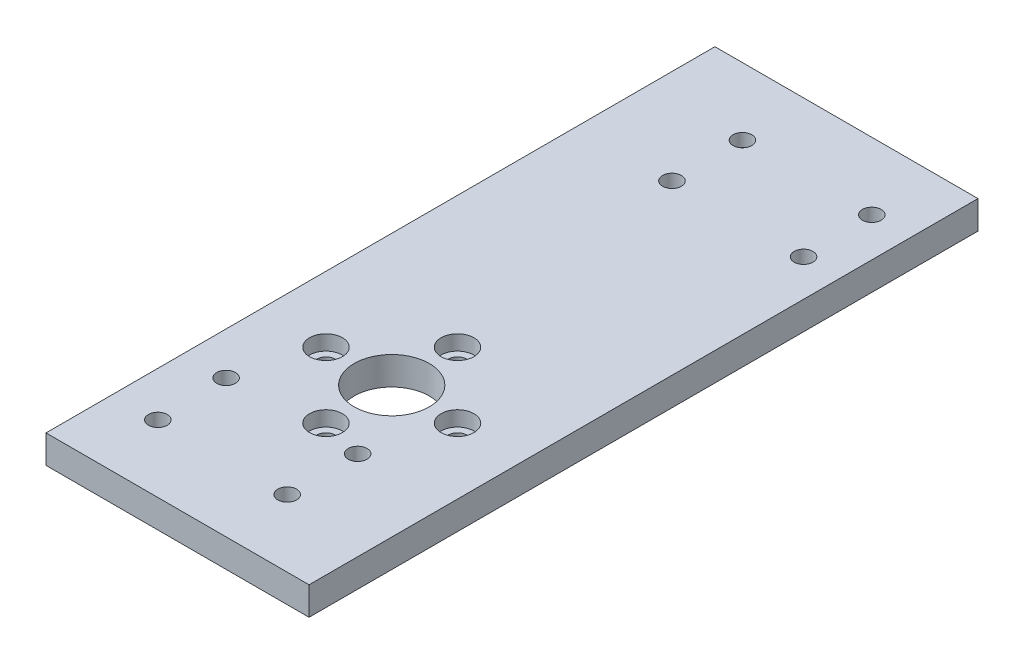
ISO-10303-21;
HEADER;
FILE_DESCRIPTION(('STEP AP214'),'2;1');
FILE_NAME('part.step','',(''),(''),'','','');
FILE_SCHEMA(('AUTOMOTIVE_DESIGN { 1 0 10303 214 1 1 1 1 }'));
ENDSEC;
DATA;
#1=APPLICATION_CONTEXT('core data for automotive mechanical design processes');
#2=APPLICATION_PROTOCOL_DEFINITION('international standard','automotive_design',2000,#1);
#3=PRODUCT_CONTEXT('',#1,'mechanical');
#4=PRODUCT('Part','Part','',(#3));
#5=PRODUCT_RELATED_PRODUCT_CATEGORY('part','',(#4));
#6=PRODUCT_DEFINITION_FORMATION('','',#4);
#7=PRODUCT_DEFINITION_CONTEXT('part definition',#1,'design');
#8=PRODUCT_DEFINITION('design','',#6,#7);
#9=PRODUCT_DEFINITION_SHAPE('','',#8);
#10=(LENGTH_UNIT() NAMED_UNIT(*) SI_UNIT(.MILLI.,.METRE.));
#11=(NAMED_UNIT(*) PLANE_ANGLE_UNIT() SI_UNIT($,.RADIAN.));
#12=(NAMED_UNIT(*) SI_UNIT($,.STERADIAN.) SOLID_ANGLE_UNIT());
#13=UNCERTAINTY_MEASURE_WITH_UNIT(LENGTH_MEASURE(1.E-05),#10,'distance_accuracy_value','');
#14=(GEOMETRIC_REPRESENTATION_CONTEXT(3) GLOBAL_UNCERTAINTY_ASSIGNED_CONTEXT((#13)) GLOBAL_UNIT_ASSIGNED_CONTEXT((#10,
#11,#12)) REPRESENTATION_CONTEXT('',''));
#15=CARTESIAN_POINT('',(0.,0.,0.));
#16=DIRECTION('',(0.,0.,1.));
#17=DIRECTION('',(1.,0.,0.));
#18=AXIS2_PLACEMENT_3D('',#15,#16,#17);
#19=CARTESIAN_POINT('',(-3.91877513505073,-7.,-28.4481628818932));
#20=DIRECTION('',(0.,1.,0.));
#21=DIRECTION('',(0.,0.,1.));
#22=AXIS2_PLACEMENT_3D('',#19,#20,#21);
#23=CYLINDRICAL_SURFACE('',#22,1.00000000000001);
#24=CARTESIAN_POINT('',(-3.91877513505073,3.,-28.4481628818932));
#25=DIRECTION('',(0.,1.,0.));
#26=DIRECTION('',(0.,0.,1.));
#27=AXIS2_PLACEMENT_3D('',#24,#25,#26);
#28=CIRCLE('',#27,1.00000000000001);
#29=CARTESIAN_POINT('',(-3.91877513505073,3.,-27.4481628818932));
#30=VERTEX_POINT('',#29);
#31=EDGE_CURVE('E244',#30,#30,#28,.T.);
#32=ORIENTED_EDGE('',*,*,#31,.T.);
#33=EDGE_LOOP('',(#32));
#34=FACE_BOUND('',#33,.T.);
#35=CARTESIAN_POINT('',(-3.91877513505073,1.6,-28.4481628818932));
#36=DIRECTION('',(0.,-1.,0.));
#37=DIRECTION('',(0.,0.,-1.));
#38=AXIS2_PLACEMENT_3D('',#35,#36,#37);
#39=CIRCLE('',#38,1.00000000000001);
#40=CARTESIAN_POINT('',(-3.91877513505073,1.6,-29.4481628818932));
#41=VERTEX_POINT('',#40);
#42=EDGE_CURVE('E43',#41,#41,#39,.F.);
#43=ORIENTED_EDGE('',*,*,#42,.F.);
#44=EDGE_LOOP('',(#43));
#45=FACE_BOUND('',#44,.T.);
#46=ADVANCED_FACE('F39',(#34,#45),#23,.F.);
#47=CARTESIAN_POINT('',(4.51877513505392,-7.,20.9481628818913));
#48=DIRECTION('',(0.,1.,0.));
#49=DIRECTION('',(0.,0.,1.));
#50=AXIS2_PLACEMENT_3D('',#47,#48,#49);
#51=CYLINDRICAL_SURFACE('',#50,1.00000000000002);
#52=CARTESIAN_POINT('',(4.51877513505392,3.,20.9481628818913));
#53=DIRECTION('',(0.,1.,0.));
#54=DIRECTION('',(0.,0.,1.));
#55=AXIS2_PLACEMENT_3D('',#52,#53,#54);
#56=CIRCLE('',#55,1.00000000000002);
#57=CARTESIAN_POINT('',(4.51877513505392,3.,21.9481628818913));
#58=VERTEX_POINT('',#57);
#59=EDGE_CURVE('E247',#58,#58,#56,.T.);
#60=ORIENTED_EDGE('',*,*,#59,.T.);
#61=EDGE_LOOP('',(#60));
#62=FACE_BOUND('',#61,.T.);
#63=CARTESIAN_POINT('',(4.51877513505392,1.6,20.9481628818913));
#64=DIRECTION('',(0.,-1.,0.));
#65=DIRECTION('',(0.,0.,-1.));
#66=AXIS2_PLACEMENT_3D('',#63,#64,#65);
#67=CIRCLE('',#66,1.00000000000002);
#68=CARTESIAN_POINT('',(4.51877513505392,1.6,19.9481628818913));
#69=VERTEX_POINT('',#68);
#70=EDGE_CURVE('E179',#69,#69,#67,.F.);
#71=ORIENTED_EDGE('',*,*,#70,.F.);
#72=EDGE_LOOP('',(#71));
#73=FACE_BOUND('',#72,.T.);
#74=ADVANCED_FACE('F280',(#62,#73),#51,.F.);
#75=CARTESIAN_POINT('',(4.51877513505393,-7.,28.4481628818913));
#76=DIRECTION('',(0.,1.,0.));
#77=DIRECTION('',(0.,0.,1.));
#78=AXIS2_PLACEMENT_3D('',#75,#76,#77);
#79=CYLINDRICAL_SURFACE('',#78,1.00000000000002);
#80=CARTESIAN_POINT('',(4.51877513505393,3.,28.4481628818913));
#81=DIRECTION('',(0.,1.,0.));
#82=DIRECTION('',(0.,0.,1.));
#83=AXIS2_PLACEMENT_3D('',#80,#81,#82);
#84=CIRCLE('',#83,1.00000000000002);
#85=CARTESIAN_POINT('',(4.51877513505393,3.,29.4481628818913));
#86=VERTEX_POINT('',#85);
#87=EDGE_CURVE('E250',#86,#86,#84,.T.);
#88=ORIENTED_EDGE('',*,*,#87,.T.);
#89=EDGE_LOOP('',(#88));
#90=FACE_BOUND('',#89,.T.);
#91=CARTESIAN_POINT('',(4.51877513505393,1.6,28.4481628818913));
#92=DIRECTION('',(0.,-1.,0.));
#93=DIRECTION('',(0.,0.,-1.));
#94=AXIS2_PLACEMENT_3D('',#91,#92,#93);
#95=CIRCLE('',#94,1.00000000000002);
#96=CARTESIAN_POINT('',(4.51877513505393,1.6,27.4481628818913));
#97=VERTEX_POINT('',#96);
#98=EDGE_CURVE('E175',#97,#97,#95,.F.);
#99=ORIENTED_EDGE('',*,*,#98,.F.);
#100=EDGE_LOOP('',(#99));
#101=FACE_BOUND('',#100,.T.);
#102=ADVANCED_FACE('F286',(#90,#101),#79,.F.);
#103=CARTESIAN_POINT('',(-9.48122486494609,-7.,20.9481628818913));
#104=DIRECTION('',(0.,1.,0.));
#105=DIRECTION('',(0.,0.,1.));
#106=AXIS2_PLACEMENT_3D('',#103,#104,#105);
#107=CYLINDRICAL_SURFACE('',#106,1.00000000000001);
#108=CARTESIAN_POINT('',(-9.48122486494609,3.,20.9481628818913));
#109=DIRECTION('',(0.,1.,0.));
#110=DIRECTION('',(0.,0.,1.));
#111=AXIS2_PLACEMENT_3D('',#108,#109,#110);
#112=CIRCLE('',#111,1.00000000000001);
#113=CARTESIAN_POINT('',(-9.48122486494609,3.,21.9481628818913));
#114=VERTEX_POINT('',#113);
#115=EDGE_CURVE('E256',#114,#114,#112,.T.);
#116=ORIENTED_EDGE('',*,*,#115,.T.);
#117=EDGE_LOOP('',(#116));
#118=FACE_BOUND('',#117,.T.);
#119=CARTESIAN_POINT('',(-9.48122486494609,1.6,20.9481628818913));
#120=DIRECTION('',(0.,-1.,0.));
#121=DIRECTION('',(0.,0.,-1.));
#122=AXIS2_PLACEMENT_3D('',#119,#120,#121);
#123=CIRCLE('',#122,1.00000000000001);
#124=CARTESIAN_POINT('',(-9.48122486494609,1.6,19.9481628818913));
#125=VERTEX_POINT('',#124);
#126=EDGE_CURVE('E170',#125,#125,#123,.F.);
#127=ORIENTED_EDGE('',*,*,#126,.F.);
#128=EDGE_LOOP('',(#127));
#129=FACE_BOUND('',#128,.T.);
#130=ADVANCED_FACE('F296',(#118,#129),#107,.F.);
#131=CARTESIAN_POINT('',(-9.24883244467996,-7.,28.4481628818913));
#132=DIRECTION('',(0.,1.,0.));
#133=DIRECTION('',(0.,0.,1.));
#134=AXIS2_PLACEMENT_3D('',#131,#132,#133);
#135=CYLINDRICAL_SURFACE('',#134,1.00000000000001);
#136=CARTESIAN_POINT('',(-9.24883244467996,3.,28.4481628818913));
#137=DIRECTION('',(0.,1.,0.));
#138=DIRECTION('',(0.,0.,1.));
#139=AXIS2_PLACEMENT_3D('',#136,#137,#138);
#140=CIRCLE('',#139,1.00000000000001);
#141=CARTESIAN_POINT('',(-9.24883244467996,3.,29.4481628818913));
#142=VERTEX_POINT('',#141);
#143=EDGE_CURVE('E253',#142,#142,#140,.T.);
#144=ORIENTED_EDGE('',*,*,#143,.T.);
#145=EDGE_LOOP('',(#144));
#146=FACE_BOUND('',#145,.T.);
#147=CARTESIAN_POINT('',(-9.24883244467996,1.6,28.4481628818913));
#148=DIRECTION('',(0.,-1.,0.));
#149=DIRECTION('',(0.,0.,-1.));
#150=AXIS2_PLACEMENT_3D('',#147,#148,#149);
#151=CIRCLE('',#150,1.00000000000001);
#152=CARTESIAN_POINT('',(-9.24883244467996,1.6,27.4481628818913));
#153=VERTEX_POINT('',#152);
#154=EDGE_CURVE('E165',#153,#153,#151,.F.);
#155=ORIENTED_EDGE('',*,*,#154,.F.);
#156=EDGE_LOOP('',(#155));
#157=FACE_BOUND('',#156,.T.);
#158=ADVANCED_FACE('F298',(#146,#157),#135,.F.);
#159=CARTESIAN_POINT('',(10.0812248649493,-7.,-20.9481628818932));
#160=DIRECTION('',(0.,1.,0.));
#161=DIRECTION('',(0.,0.,1.));
#162=AXIS2_PLACEMENT_3D('',#159,#160,#161);
#163=CYLINDRICAL_SURFACE('',#162,1.);
#164=CARTESIAN_POINT('',(10.0812248649493,3.,-20.9481628818932));
#165=DIRECTION('',(0.,1.,0.));
#166=DIRECTION('',(0.,0.,1.));
#167=AXIS2_PLACEMENT_3D('',#164,#165,#166);
#168=CIRCLE('',#167,1.);
#169=CARTESIAN_POINT('',(10.0812248649493,3.,-19.9481628818932));
#170=VERTEX_POINT('',#169);
#171=EDGE_CURVE('E238',#170,#170,#168,.T.);
#172=ORIENTED_EDGE('',*,*,#171,.T.);
#173=EDGE_LOOP('',(#172));
#174=FACE_BOUND('',#173,.T.);
#175=CARTESIAN_POINT('',(10.0812248649493,1.6,-20.9481628818932));
#176=DIRECTION('',(0.,-1.,0.));
#177=DIRECTION('',(0.,0.,-1.));
#178=AXIS2_PLACEMENT_3D('',#175,#176,#177);
#179=CIRCLE('',#178,1.);
#180=CARTESIAN_POINT('',(10.0812248649493,1.6,-21.9481628818932));
#181=VERTEX_POINT('',#180);
#182=EDGE_CURVE('E160',#181,#181,#179,.F.);
#183=ORIENTED_EDGE('',*,*,#182,.F.);
#184=EDGE_LOOP('',(#183));
#185=FACE_BOUND('',#184,.T.);
#186=ADVANCED_FACE('F301',(#174,#185),#163,.F.);
#187=CARTESIAN_POINT('',(9.84883244468316,-7.,-28.4481628818932));
#188=DIRECTION('',(0.,1.,0.));
#189=DIRECTION('',(0.,0.,1.));
#190=AXIS2_PLACEMENT_3D('',#187,#188,#189);
#191=CYLINDRICAL_SURFACE('',#190,1.00000000000001);
#192=CARTESIAN_POINT('',(9.84883244468316,3.,-28.4481628818932));
#193=DIRECTION('',(0.,1.,0.));
#194=DIRECTION('',(0.,0.,1.));
#195=AXIS2_PLACEMENT_3D('',#192,#193,#194);
#196=CIRCLE('',#195,1.00000000000001);
#197=CARTESIAN_POINT('',(9.84883244468316,3.,-27.4481628818932));
#198=VERTEX_POINT('',#197);
#199=EDGE_CURVE('E241',#198,#198,#196,.T.);
#200=ORIENTED_EDGE('',*,*,#199,.T.);
#201=EDGE_LOOP('',(#200));
#202=FACE_BOUND('',#201,.T.);
#203=CARTESIAN_POINT('',(9.84883244468316,1.6,-28.4481628818932));
#204=DIRECTION('',(0.,-1.,0.));
#205=DIRECTION('',(0.,0.,-1.));
#206=AXIS2_PLACEMENT_3D('',#203,#204,#205);
#207=CIRCLE('',#206,1.00000000000001);
#208=CARTESIAN_POINT('',(9.84883244468316,1.6,-29.4481628818932));
#209=VERTEX_POINT('',#208);
#210=EDGE_CURVE('E155',#209,#209,#207,.F.);
#211=ORIENTED_EDGE('',*,*,#210,.F.);
#212=EDGE_LOOP('',(#211));
#213=FACE_BOUND('',#212,.T.);
#214=ADVANCED_FACE('F291',(#202,#213),#191,.F.);
#215=CARTESIAN_POINT('',(-3.91877513505072,-7.,-20.9481628818932));
#216=DIRECTION('',(0.,1.,0.));
#217=DIRECTION('',(0.,0.,1.));
#218=AXIS2_PLACEMENT_3D('',#215,#216,#217);
#219=CYLINDRICAL_SURFACE('',#218,1.00000000000001);
#220=CARTESIAN_POINT('',(-3.91877513505072,3.,-20.9481628818932));
#221=DIRECTION('',(0.,1.,0.));
#222=DIRECTION('',(0.,0.,1.));
#223=AXIS2_PLACEMENT_3D('',#220,#221,#222);
#224=CIRCLE('',#223,1.00000000000001);
#225=CARTESIAN_POINT('',(-3.91877513505072,3.,-19.9481628818932));
#226=VERTEX_POINT('',#225);
#227=EDGE_CURVE('E133',#226,#226,#224,.T.);
#228=ORIENTED_EDGE('',*,*,#227,.T.);
#229=EDGE_LOOP('',(#228));
#230=FACE_BOUND('',#229,.T.);
#231=CARTESIAN_POINT('',(-3.91877513505072,1.6,-20.9481628818932));
#232=DIRECTION('',(0.,-1.,0.));
#233=DIRECTION('',(0.,0.,-1.));
#234=AXIS2_PLACEMENT_3D('',#231,#232,#233);
#235=CIRCLE('',#234,1.00000000000001);
#236=CARTESIAN_POINT('',(-3.91877513505072,1.6,-21.9481628818932));
#237=VERTEX_POINT('',#236);
#238=EDGE_CURVE('E150',#237,#237,#235,.F.);
#239=ORIENTED_EDGE('',*,*,#238,.F.);
#240=EDGE_LOOP('',(#239));
#241=FACE_BOUND('',#240,.T.);
#242=ADVANCED_FACE('F321',(#230,#241),#219,.F.);
#243=CARTESIAN_POINT('',(7.0000000000001,-7.,12.7999999999978));
#244=DIRECTION('',(0.,1.,0.));
#245=DIRECTION('',(0.,0.,1.));
#246=AXIS2_PLACEMENT_3D('',#243,#244,#245);
#247=CYLINDRICAL_SURFACE('',#246,1.);
#248=CARTESIAN_POINT('',(7.0000000000001,0.,12.7999999999978));
#249=DIRECTION('',(0.,-1.,0.));
#250=DIRECTION('',(0.,0.,-1.));
#251=AXIS2_PLACEMENT_3D('',#248,#249,#250);
#252=CIRCLE('',#251,1.);
#253=CARTESIAN_POINT('',(7.0000000000001,0.,11.7999999999978));
#254=VERTEX_POINT('',#253);
#255=EDGE_CURVE('E117',#254,#254,#252,.T.);
#256=ORIENTED_EDGE('',*,*,#255,.T.);
#257=EDGE_LOOP('',(#256));
#258=FACE_BOUND('',#257,.T.);
#259=CARTESIAN_POINT('',(7.0000000000001,1.4,12.7999999999978));
#260=DIRECTION('',(0.,1.,0.));
#261=DIRECTION('',(0.,0.,1.));
#262=AXIS2_PLACEMENT_3D('',#259,#260,#261);
#263=CIRCLE('',#262,1.);
#264=CARTESIAN_POINT('',(7.0000000000001,1.4,13.7999999999978));
#265=VERTEX_POINT('',#264);
#266=EDGE_CURVE('E145',#265,#265,#263,.F.);
#267=ORIENTED_EDGE('',*,*,#266,.F.);
#268=EDGE_LOOP('',(#267));
#269=FACE_BOUND('',#268,.T.);
#270=ADVANCED_FACE('F314',(#258,#269),#247,.F.);
#271=CARTESIAN_POINT('',(-6.9999999999999,-7.,12.7999999999979));
#272=DIRECTION('',(0.,1.,0.));
#273=DIRECTION('',(0.,0.,1.));
#274=AXIS2_PLACEMENT_3D('',#271,#272,#273);
#275=CYLINDRICAL_SURFACE('',#274,1.);
#276=CARTESIAN_POINT('',(-6.9999999999999,0.,12.7999999999979));
#277=DIRECTION('',(0.,-1.,0.));
#278=DIRECTION('',(0.,0.,-1.));
#279=AXIS2_PLACEMENT_3D('',#276,#277,#278);
#280=CIRCLE('',#279,1.);
#281=CARTESIAN_POINT('',(-6.9999999999999,0.,11.7999999999979));
#282=VERTEX_POINT('',#281);
#283=EDGE_CURVE('E123',#282,#282,#280,.T.);
#284=ORIENTED_EDGE('',*,*,#283,.T.);
#285=EDGE_LOOP('',(#284));
#286=FACE_BOUND('',#285,.T.);
#287=CARTESIAN_POINT('',(-6.9999999999999,1.4,12.7999999999979));
#288=DIRECTION('',(0.,1.,0.));
#289=DIRECTION('',(0.,0.,1.));
#290=AXIS2_PLACEMENT_3D('',#287,#288,#289);
#291=CIRCLE('',#290,1.);
#292=CARTESIAN_POINT('',(-6.9999999999999,1.4,13.7999999999979));
#293=VERTEX_POINT('',#292);
#294=EDGE_CURVE('E140',#293,#293,#291,.F.);
#295=ORIENTED_EDGE('',*,*,#294,.F.);
#296=EDGE_LOOP('',(#295));
#297=FACE_BOUND('',#296,.T.);
#298=ADVANCED_FACE('F310',(#286,#297),#275,.F.);
#299=CARTESIAN_POINT('',(0.,-7.,5.79999999999792));
#300=DIRECTION('',(0.,1.,0.));
#301=DIRECTION('',(0.,0.,1.));
#302=AXIS2_PLACEMENT_3D('',#299,#300,#301);
#303=CYLINDRICAL_SURFACE('',#302,1.);
#304=CARTESIAN_POINT('',(0.,0.,5.79999999999792));
#305=DIRECTION('',(0.,-1.,0.));
#306=DIRECTION('',(0.,0.,-1.));
#307=AXIS2_PLACEMENT_3D('',#304,#305,#306);
#308=CIRCLE('',#307,1.);
#309=CARTESIAN_POINT('',(0.,0.,4.79999999999792));
#310=VERTEX_POINT('',#309);
#311=EDGE_CURVE('E109',#310,#310,#308,.T.);
#312=ORIENTED_EDGE('',*,*,#311,.T.);
#313=EDGE_LOOP('',(#312));
#314=FACE_BOUND('',#313,.T.);
#315=CARTESIAN_POINT('',(0.,1.4,5.79999999999792));
#316=DIRECTION('',(0.,1.,0.));
#317=DIRECTION('',(0.,0.,1.));
#318=AXIS2_PLACEMENT_3D('',#315,#316,#317);
#319=CIRCLE('',#318,1.);
#320=CARTESIAN_POINT('',(0.,1.4,6.79999999999792));
#321=VERTEX_POINT('',#320);
#322=EDGE_CURVE('E135',#321,#321,#319,.F.);
#323=ORIENTED_EDGE('',*,*,#322,.F.);
#324=EDGE_LOOP('',(#323));
#325=FACE_BOUND('',#324,.T.);
#326=ADVANCED_FACE('F313',(#314,#325),#303,.F.);
#327=CARTESIAN_POINT('',(1.45764745514838E-13,-7.,19.7999999999979));
#328=DIRECTION('',(0.,1.,0.));
#329=DIRECTION('',(0.,0.,1.));
#330=AXIS2_PLACEMENT_3D('',#327,#328,#329);
#331=CYLINDRICAL_SURFACE('',#330,1.);
#332=CARTESIAN_POINT('',(1.45764745514838E-13,0.,19.7999999999979));
#333=DIRECTION('',(0.,-1.,0.));
#334=DIRECTION('',(0.,0.,-1.));
#335=AXIS2_PLACEMENT_3D('',#332,#333,#334);
#336=CIRCLE('',#335,1.);
#337=CARTESIAN_POINT('',(1.45764745514838E-13,0.,18.7999999999979));
#338=VERTEX_POINT('',#337);
#339=EDGE_CURVE('E120',#338,#338,#336,.T.);
#340=ORIENTED_EDGE('',*,*,#339,.T.);
#341=EDGE_LOOP('',(#340));
#342=FACE_BOUND('',#341,.T.);
#343=CARTESIAN_POINT('',(1.45764745514838E-13,1.4,19.7999999999979));
#344=DIRECTION('',(0.,1.,0.));
#345=DIRECTION('',(0.,0.,1.));
#346=AXIS2_PLACEMENT_3D('',#343,#344,#345);
#347=CIRCLE('',#346,1.);
#348=CARTESIAN_POINT('',(1.45764745514838E-13,1.4,20.7999999999979));
#349=VERTEX_POINT('',#348);
#350=EDGE_CURVE('E130',#349,#349,#347,.F.);
#351=ORIENTED_EDGE('',*,*,#350,.F.);
#352=EDGE_LOOP('',(#351));
#353=FACE_BOUND('',#352,.T.);
#354=ADVANCED_FACE('F316',(#342,#353),#331,.F.);
#355=CARTESIAN_POINT('',(14.,3.,35.6));
#356=DIRECTION('',(-1.,0.,0.));
#357=DIRECTION('',(0.,0.,1.));
#358=AXIS2_PLACEMENT_3D('',#355,#356,#357);
#359=PLANE('',#358);
#360=DIRECTION('',(0.,0.,-1.));
#361=VECTOR('',#360,1.);
#362=CARTESIAN_POINT('',(14.,0.,35.6));
#363=LINE('',#362,#361);
#364=CARTESIAN_POINT('',(14.,0.,35.6));
#365=VERTEX_POINT('',#364);
#366=CARTESIAN_POINT('',(14.,0.,-35.6));
#367=VERTEX_POINT('',#366);
#368=EDGE_CURVE('E106',#365,#367,#363,.T.);
#369=ORIENTED_EDGE('',*,*,#368,.T.);
#370=DIRECTION('',(0.,-1.,0.));
#371=VECTOR('',#370,1.);
#372=CARTESIAN_POINT('',(14.,3.,-35.6));
#373=LINE('',#372,#371);
#374=CARTESIAN_POINT('',(14.,3.,-35.6));
#375=VERTEX_POINT('',#374);
#376=EDGE_CURVE('E11',#375,#367,#373,.T.);
#377=ORIENTED_EDGE('',*,*,#376,.F.);
#378=DIRECTION('',(0.,0.,-1.));
#379=VECTOR('',#378,1.);
#380=CARTESIAN_POINT('',(14.,3.,35.6));
#381=LINE('',#380,#379);
#382=CARTESIAN_POINT('',(14.,3.,35.6));
#383=VERTEX_POINT('',#382);
#384=EDGE_CURVE('E93',#383,#375,#381,.T.);
#385=ORIENTED_EDGE('',*,*,#384,.F.);
#386=DIRECTION('',(0.,-1.,0.));
#387=VECTOR('',#386,1.);
#388=CARTESIAN_POINT('',(14.,3.,35.6));
#389=LINE('',#388,#387);
#390=EDGE_CURVE('E102',#383,#365,#389,.T.);
#391=ORIENTED_EDGE('',*,*,#390,.T.);
#392=EDGE_LOOP('',(#369,#377,#385,#391));
#393=FACE_BOUND('',#392,.T.);
#394=ADVANCED_FACE('F41',(#393),#359,.F.);
#395=CARTESIAN_POINT('',(-14.,3.,-35.6));
#396=DIRECTION('',(0.,0.,1.));
#397=DIRECTION('',(1.,0.,0.));
#398=AXIS2_PLACEMENT_3D('',#395,#396,#397);
#399=PLANE('',#398);
#400=DIRECTION('',(-1.,0.,0.));
#401=VECTOR('',#400,1.);
#402=CARTESIAN_POINT('',(-14.,0.,-35.6));
#403=LINE('',#402,#401);
#404=CARTESIAN_POINT('',(-14.,0.,-35.6));
#405=VERTEX_POINT('',#404);
#406=EDGE_CURVE('E97',#367,#405,#403,.T.);
#407=ORIENTED_EDGE('',*,*,#406,.T.);
#408=DIRECTION('',(0.,-1.,0.));
#409=VECTOR('',#408,1.);
#410=CARTESIAN_POINT('',(-14.,3.,-35.6));
#411=LINE('',#410,#409);
#412=CARTESIAN_POINT('',(-14.,3.,-35.6));
#413=VERTEX_POINT('',#412);
#414=EDGE_CURVE('E49',#413,#405,#411,.T.);
#415=ORIENTED_EDGE('',*,*,#414,.F.);
#416=DIRECTION('',(-1.,0.,0.));
#417=VECTOR('',#416,1.);
#418=CARTESIAN_POINT('',(-14.,3.,-35.6));
#419=LINE('',#418,#417);
#420=EDGE_CURVE('E88',#375,#413,#419,.T.);
#421=ORIENTED_EDGE('',*,*,#420,.F.);
#422=ORIENTED_EDGE('',*,*,#376,.T.);
#423=EDGE_LOOP('',(#407,#415,#421,#422));
#424=FACE_BOUND('',#423,.T.);
#425=ADVANCED_FACE('F96',(#424),#399,.F.);
#426=CARTESIAN_POINT('',(-14.,3.,35.6));
#427=DIRECTION('',(1.,0.,0.));
#428=DIRECTION('',(0.,0.,-1.));
#429=AXIS2_PLACEMENT_3D('',#426,#427,#428);
#430=PLANE('',#429);
#431=DIRECTION('',(0.,0.,1.));
#432=VECTOR('',#431,1.);
#433=CARTESIAN_POINT('',(-14.,0.,35.6));
#434=LINE('',#433,#432);
#435=CARTESIAN_POINT('',(-14.,0.,35.6));
#436=VERTEX_POINT('',#435);
#437=EDGE_CURVE('E75',#405,#436,#434,.T.);
#438=ORIENTED_EDGE('',*,*,#437,.T.);
#439=DIRECTION('',(0.,-1.,0.));
#440=VECTOR('',#439,1.);
#441=CARTESIAN_POINT('',(-14.,3.,35.6));
#442=LINE('',#441,#440);
#443=CARTESIAN_POINT('',(-14.,3.,35.6));
#444=VERTEX_POINT('',#443);
#445=EDGE_CURVE('E98',#444,#436,#442,.T.);
#446=ORIENTED_EDGE('',*,*,#445,.F.);
#447=DIRECTION('',(0.,0.,1.));
#448=VECTOR('',#447,1.);
#449=CARTESIAN_POINT('',(-14.,3.,35.6));
#450=LINE('',#449,#448);
#451=EDGE_CURVE('E91',#413,#444,#450,.T.);
#452=ORIENTED_EDGE('',*,*,#451,.F.);
#453=ORIENTED_EDGE('',*,*,#414,.T.);
#454=EDGE_LOOP('',(#438,#446,#452,#453));
#455=FACE_BOUND('',#454,.T.);
#456=ADVANCED_FACE('F100',(#455),#430,.F.);
#457=CARTESIAN_POINT('',(-14.,3.,35.6));
#458=DIRECTION('',(0.,0.,-1.));
#459=DIRECTION('',(-1.,0.,0.));
#460=AXIS2_PLACEMENT_3D('',#457,#458,#459);
#461=PLANE('',#460);
#462=DIRECTION('',(1.,0.,0.));
#463=VECTOR('',#462,1.);
#464=CARTESIAN_POINT('',(-14.,0.,35.6));
#465=LINE('',#464,#463);
#466=EDGE_CURVE('E81',#436,#365,#465,.T.);
#467=ORIENTED_EDGE('',*,*,#466,.T.);
#468=ORIENTED_EDGE('',*,*,#390,.F.);
#469=DIRECTION('',(1.,0.,0.));
#470=VECTOR('',#469,1.);
#471=CARTESIAN_POINT('',(-14.,3.,35.6));
#472=LINE('',#471,#470);
#473=EDGE_CURVE('E58',#444,#383,#472,.T.);
#474=ORIENTED_EDGE('',*,*,#473,.F.);
#475=ORIENTED_EDGE('',*,*,#445,.T.);
#476=EDGE_LOOP('',(#467,#468,#474,#475));
#477=FACE_BOUND('',#476,.T.);
#478=ADVANCED_FACE('F266',(#477),#461,.F.);
#479=CARTESIAN_POINT('',(0.,3.,0.));
#480=DIRECTION('',(0.,-1.,0.));
#481=DIRECTION('',(0.,0.,-1.));
#482=AXIS2_PLACEMENT_3D('',#479,#480,#481);
#483=PLANE('',#482);
#484=CARTESIAN_POINT('',(7.0000000000001,3.,12.7999999999978));
#485=DIRECTION('',(0.,1.,0.));
#486=DIRECTION('',(0.,0.,1.));
#487=AXIS2_PLACEMENT_3D('',#484,#485,#486);
#488=CIRCLE('',#487,1.75);
#489=CARTESIAN_POINT('',(7.0000000000001,3.,14.5499999999978));
#490=VERTEX_POINT('',#489);
#491=EDGE_CURVE('E153',#490,#490,#488,.T.);
#492=ORIENTED_EDGE('',*,*,#491,.F.);
#493=EDGE_LOOP('',(#492));
#494=FACE_BOUND('',#493,.T.);
#495=CARTESIAN_POINT('',(-6.9999999999999,3.,12.7999999999979));
#496=DIRECTION('',(0.,1.,0.));
#497=DIRECTION('',(0.,0.,1.));
#498=AXIS2_PLACEMENT_3D('',#495,#496,#497);
#499=CIRCLE('',#498,1.75);
#500=CARTESIAN_POINT('',(-6.9999999999999,3.,14.5499999999979));
#501=VERTEX_POINT('',#500);
#502=EDGE_CURVE('E148',#501,#501,#499,.T.);
#503=ORIENTED_EDGE('',*,*,#502,.F.);
#504=EDGE_LOOP('',(#503));
#505=FACE_BOUND('',#504,.T.);
#506=CARTESIAN_POINT('',(0.,3.,5.79999999999792));
#507=DIRECTION('',(0.,1.,0.));
#508=DIRECTION('',(0.,0.,1.));
#509=AXIS2_PLACEMENT_3D('',#506,#507,#508);
#510=CIRCLE('',#509,1.75);
#511=CARTESIAN_POINT('',(0.,3.,7.54999999999792));
#512=VERTEX_POINT('',#511);
#513=EDGE_CURVE('E143',#512,#512,#510,.T.);
#514=ORIENTED_EDGE('',*,*,#513,.F.);
#515=EDGE_LOOP('',(#514));
#516=FACE_BOUND('',#515,.T.);
#517=CARTESIAN_POINT('',(1.45764745514838E-13,3.,19.7999999999979));
#518=DIRECTION('',(0.,1.,0.));
#519=DIRECTION('',(0.,0.,1.));
#520=AXIS2_PLACEMENT_3D('',#517,#518,#519);
#521=CIRCLE('',#520,1.75);
#522=CARTESIAN_POINT('',(1.45764745514838E-13,3.,21.5499999999979));
#523=VERTEX_POINT('',#522);
#524=EDGE_CURVE('E138',#523,#523,#521,.T.);
#525=ORIENTED_EDGE('',*,*,#524,.F.);
#526=EDGE_LOOP('',(#525));
#527=FACE_BOUND('',#526,.T.);
#528=ORIENTED_EDGE('',*,*,#227,.F.);
#529=EDGE_LOOP('',(#528));
#530=FACE_BOUND('',#529,.T.);
#531=ORIENTED_EDGE('',*,*,#171,.F.);
#532=EDGE_LOOP('',(#531));
#533=FACE_BOUND('',#532,.T.);
#534=ORIENTED_EDGE('',*,*,#199,.F.);
#535=EDGE_LOOP('',(#534));
#536=FACE_BOUND('',#535,.T.);
#537=ORIENTED_EDGE('',*,*,#31,.F.);
#538=EDGE_LOOP('',(#537));
#539=FACE_BOUND('',#538,.T.);
#540=ORIENTED_EDGE('',*,*,#59,.F.);
#541=EDGE_LOOP('',(#540));
#542=FACE_BOUND('',#541,.T.);
#543=ORIENTED_EDGE('',*,*,#87,.F.);
#544=EDGE_LOOP('',(#543));
#545=FACE_BOUND('',#544,.T.);
#546=ORIENTED_EDGE('',*,*,#143,.F.);
#547=EDGE_LOOP('',(#546));
#548=FACE_BOUND('',#547,.T.);
#549=ORIENTED_EDGE('',*,*,#115,.F.);
#550=EDGE_LOOP('',(#549));
#551=FACE_BOUND('',#550,.T.);
#552=CARTESIAN_POINT('',(0.,3.,12.7999999999985));
#553=DIRECTION('',(0.,1.,0.));
#554=DIRECTION('',(0.,0.,1.));
#555=AXIS2_PLACEMENT_3D('',#552,#553,#554);
#556=CIRCLE('',#555,4.);
#557=CARTESIAN_POINT('',(0.,3.,16.7999999999985));
#558=VERTEX_POINT('',#557);
#559=EDGE_CURVE('E129',#558,#558,#556,.T.);
#560=ORIENTED_EDGE('',*,*,#559,.F.);
#561=EDGE_LOOP('',(#560));
#562=FACE_BOUND('',#561,.T.);
#563=ORIENTED_EDGE('',*,*,#384,.T.);
#564=ORIENTED_EDGE('',*,*,#420,.T.);
#565=ORIENTED_EDGE('',*,*,#451,.T.);
#566=ORIENTED_EDGE('',*,*,#473,.T.);
#567=EDGE_LOOP('',(#563,#564,#565,#566));
#568=FACE_BOUND('',#567,.T.);
#569=ADVANCED_FACE('F89',(#494,#505,#516,#527,#530,#533,#536,#539,#542,#545,#548,#551,#562,
#568),#483,.F.);
#570=CARTESIAN_POINT('',(0.,0.,0.));
#571=DIRECTION('',(0.,-1.,0.));
#572=DIRECTION('',(0.,0.,-1.));
#573=AXIS2_PLACEMENT_3D('',#570,#571,#572);
#574=PLANE('',#573);
#575=CARTESIAN_POINT('',(-3.91877513505052,0.,-28.4481628818932));
#576=DIRECTION('',(0.,-1.,0.));
#577=DIRECTION('',(0.,0.,-1.));
#578=AXIS2_PLACEMENT_3D('',#575,#576,#577);
#579=CIRCLE('',#578,1.75);
#580=CARTESIAN_POINT('',(-3.91877513505052,0.,-30.1981628818932));
#581=VERTEX_POINT('',#580);
#582=EDGE_CURVE('E195',#581,#581,#579,.T.);
#583=ORIENTED_EDGE('',*,*,#582,.F.);
#584=EDGE_LOOP('',(#583));
#585=FACE_BOUND('',#584,.T.);
#586=CARTESIAN_POINT('',(4.51877513505412,0.,20.9481628818913));
#587=DIRECTION('',(0.,-1.,0.));
#588=DIRECTION('',(0.,0.,-1.));
#589=AXIS2_PLACEMENT_3D('',#586,#587,#588);
#590=CIRCLE('',#589,1.74999999999999);
#591=CARTESIAN_POINT('',(4.51877513505412,0.,19.1981628818913));
#592=VERTEX_POINT('',#591);
#593=EDGE_CURVE('E188',#592,#592,#590,.T.);
#594=ORIENTED_EDGE('',*,*,#593,.F.);
#595=EDGE_LOOP('',(#594));
#596=FACE_BOUND('',#595,.T.);
#597=CARTESIAN_POINT('',(4.51877513505413,0.,28.4481628818913));
#598=DIRECTION('',(0.,-1.,0.));
#599=DIRECTION('',(0.,0.,-1.));
#600=AXIS2_PLACEMENT_3D('',#597,#598,#599);
#601=CIRCLE('',#600,1.74999999999999);
#602=CARTESIAN_POINT('',(4.51877513505413,0.,26.6981628818913));
#603=VERTEX_POINT('',#602);
#604=EDGE_CURVE('E181',#603,#603,#601,.T.);
#605=ORIENTED_EDGE('',*,*,#604,.F.);
#606=EDGE_LOOP('',(#605));
#607=FACE_BOUND('',#606,.T.);
#608=CARTESIAN_POINT('',(-9.48122486494588,0.,20.9481628818913));
#609=DIRECTION('',(0.,-1.,0.));
#610=DIRECTION('',(0.,0.,-1.));
#611=AXIS2_PLACEMENT_3D('',#608,#609,#610);
#612=CIRCLE('',#611,1.75000000000001);
#613=CARTESIAN_POINT('',(-9.48122486494588,0.,19.1981628818913));
#614=VERTEX_POINT('',#613);
#615=EDGE_CURVE('E177',#614,#614,#612,.T.);
#616=ORIENTED_EDGE('',*,*,#615,.F.);
#617=EDGE_LOOP('',(#616));
#618=FACE_BOUND('',#617,.T.);
#619=CARTESIAN_POINT('',(-9.24883244467975,0.,28.4481628818914));
#620=DIRECTION('',(0.,-1.,0.));
#621=DIRECTION('',(0.,0.,-1.));
#622=AXIS2_PLACEMENT_3D('',#619,#620,#621);
#623=CIRCLE('',#622,1.75000000000001);
#624=CARTESIAN_POINT('',(-9.24883244467975,0.,26.6981628818913));
#625=VERTEX_POINT('',#624);
#626=EDGE_CURVE('E173',#625,#625,#623,.T.);
#627=ORIENTED_EDGE('',*,*,#626,.F.);
#628=EDGE_LOOP('',(#627));
#629=FACE_BOUND('',#628,.T.);
#630=CARTESIAN_POINT('',(10.0812248649495,0.,-20.9481628818932));
#631=DIRECTION('',(0.,-1.,0.));
#632=DIRECTION('',(0.,0.,-1.));
#633=AXIS2_PLACEMENT_3D('',#630,#631,#632);
#634=CIRCLE('',#633,1.75);
#635=CARTESIAN_POINT('',(10.0812248649495,0.,-22.6981628818932));
#636=VERTEX_POINT('',#635);
#637=EDGE_CURVE('E168',#636,#636,#634,.T.);
#638=ORIENTED_EDGE('',*,*,#637,.F.);
#639=EDGE_LOOP('',(#638));
#640=FACE_BOUND('',#639,.T.);
#641=CARTESIAN_POINT('',(9.84883244468337,0.,-28.4481628818932));
#642=DIRECTION('',(0.,-1.,0.));
#643=DIRECTION('',(0.,0.,-1.));
#644=AXIS2_PLACEMENT_3D('',#641,#642,#643);
#645=CIRCLE('',#644,1.75);
#646=CARTESIAN_POINT('',(9.84883244468337,0.,-30.1981628818932));
#647=VERTEX_POINT('',#646);
#648=EDGE_CURVE('E163',#647,#647,#645,.T.);
#649=ORIENTED_EDGE('',*,*,#648,.F.);
#650=EDGE_LOOP('',(#649));
#651=FACE_BOUND('',#650,.T.);
#652=CARTESIAN_POINT('',(-3.91877513505052,0.,-20.9481628818932));
#653=DIRECTION('',(0.,-1.,0.));
#654=DIRECTION('',(0.,0.,-1.));
#655=AXIS2_PLACEMENT_3D('',#652,#653,#654);
#656=CIRCLE('',#655,1.75000000000001);
#657=CARTESIAN_POINT('',(-3.91877513505052,0.,-22.6981628818932));
#658=VERTEX_POINT('',#657);
#659=EDGE_CURVE('E158',#658,#658,#656,.T.);
#660=ORIENTED_EDGE('',*,*,#659,.F.);
#661=EDGE_LOOP('',(#660));
#662=FACE_BOUND('',#661,.T.);
#663=CARTESIAN_POINT('',(0.,0.,12.7999999999985));
#664=DIRECTION('',(0.,-1.,0.));
#665=DIRECTION('',(0.,0.,-1.));
#666=AXIS2_PLACEMENT_3D('',#663,#664,#665);
#667=CIRCLE('',#666,4.);
#668=CARTESIAN_POINT('',(0.,0.,8.79999999999852));
#669=VERTEX_POINT('',#668);
#670=EDGE_CURVE('E126',#669,#669,#667,.T.);
#671=ORIENTED_EDGE('',*,*,#670,.F.);
#672=EDGE_LOOP('',(#671));
#673=FACE_BOUND('',#672,.T.);
#674=ORIENTED_EDGE('',*,*,#283,.F.);
#675=EDGE_LOOP('',(#674));
#676=FACE_BOUND('',#675,.T.);
#677=ORIENTED_EDGE('',*,*,#339,.F.);
#678=EDGE_LOOP('',(#677));
#679=FACE_BOUND('',#678,.T.);
#680=ORIENTED_EDGE('',*,*,#255,.F.);
#681=EDGE_LOOP('',(#680));
#682=FACE_BOUND('',#681,.T.);
#683=ORIENTED_EDGE('',*,*,#311,.F.);
#684=EDGE_LOOP('',(#683));
#685=FACE_BOUND('',#684,.T.);
#686=ORIENTED_EDGE('',*,*,#368,.F.);
#687=ORIENTED_EDGE('',*,*,#466,.F.);
#688=ORIENTED_EDGE('',*,*,#437,.F.);
#689=ORIENTED_EDGE('',*,*,#406,.F.);
#690=EDGE_LOOP('',(#686,#687,#688,#689));
#691=FACE_BOUND('',#690,.T.);
#692=ADVANCED_FACE('F265',(#585,#596,#607,#618,#629,#640,#651,#662,#673,#676,#679,#682,#685,
#691),#574,.T.);
#693=CARTESIAN_POINT('',(0.,-7.,12.7999999999985));
#694=DIRECTION('',(0.,1.,0.));
#695=DIRECTION('',(0.,0.,1.));
#696=AXIS2_PLACEMENT_3D('',#693,#694,#695);
#697=CYLINDRICAL_SURFACE('',#696,4.);
#698=ORIENTED_EDGE('',*,*,#670,.T.);
#699=EDGE_LOOP('',(#698));
#700=FACE_BOUND('',#699,.T.);
#701=ORIENTED_EDGE('',*,*,#559,.T.);
#702=EDGE_LOOP('',(#701));
#703=FACE_BOUND('',#702,.T.);
#704=ADVANCED_FACE('F262',(#700,#703),#697,.F.);
#705=CARTESIAN_POINT('',(1.45764745514838E-13,1.4,19.7999999999979));
#706=DIRECTION('',(0.,1.,0.));
#707=DIRECTION('',(0.,0.,1.));
#708=AXIS2_PLACEMENT_3D('',#705,#706,#707);
#709=PLANE('',#708);
#710=CARTESIAN_POINT('',(1.45764745514838E-13,1.4,19.7999999999979));
#711=DIRECTION('',(0.,1.,0.));
#712=DIRECTION('',(0.,0.,1.));
#713=AXIS2_PLACEMENT_3D('',#710,#711,#712);
#714=CIRCLE('',#713,1.75);
#715=CARTESIAN_POINT('',(1.45764745514838E-13,1.4,21.5499999999979));
#716=VERTEX_POINT('',#715);
#717=EDGE_CURVE('E134',#716,#716,#714,.T.);
#718=ORIENTED_EDGE('',*,*,#717,.T.);
#719=EDGE_LOOP('',(#718));
#720=FACE_BOUND('',#719,.T.);
#721=ORIENTED_EDGE('',*,*,#350,.T.);
#722=EDGE_LOOP('',(#721));
#723=FACE_BOUND('',#722,.T.);
#724=ADVANCED_FACE('F308',(#720,#723),#709,.T.);
#725=CARTESIAN_POINT('',(1.45764745514838E-13,1.4,19.7999999999979));
#726=DIRECTION('',(0.,1.,0.));
#727=DIRECTION('',(0.,0.,1.));
#728=AXIS2_PLACEMENT_3D('',#725,#726,#727);
#729=CYLINDRICAL_SURFACE('',#728,1.75);
#730=ORIENTED_EDGE('',*,*,#717,.F.);
#731=EDGE_LOOP('',(#730));
#732=FACE_BOUND('',#731,.T.);
#733=ORIENTED_EDGE('',*,*,#524,.T.);
#734=EDGE_LOOP('',(#733));
#735=FACE_BOUND('',#734,.T.);
#736=ADVANCED_FACE('F334',(#732,#735),#729,.F.);
#737=CARTESIAN_POINT('',(0.,1.4,5.79999999999792));
#738=DIRECTION('',(0.,1.,0.));
#739=DIRECTION('',(0.,0.,1.));
#740=AXIS2_PLACEMENT_3D('',#737,#738,#739);
#741=PLANE('',#740);
#742=CARTESIAN_POINT('',(0.,1.4,5.79999999999792));
#743=DIRECTION('',(0.,1.,0.));
#744=DIRECTION('',(0.,0.,1.));
#745=AXIS2_PLACEMENT_3D('',#742,#743,#744);
#746=CIRCLE('',#745,1.75);
#747=CARTESIAN_POINT('',(0.,1.4,7.54999999999792));
#748=VERTEX_POINT('',#747);
#749=EDGE_CURVE('E139',#748,#748,#746,.T.);
#750=ORIENTED_EDGE('',*,*,#749,.T.);
#751=EDGE_LOOP('',(#750));
#752=FACE_BOUND('',#751,.T.);
#753=ORIENTED_EDGE('',*,*,#322,.T.);
#754=EDGE_LOOP('',(#753));
#755=FACE_BOUND('',#754,.T.);
#756=ADVANCED_FACE('F331',(#752,#755),#741,.T.);
#757=CARTESIAN_POINT('',(0.,1.4,5.79999999999792));
#758=DIRECTION('',(0.,1.,0.));
#759=DIRECTION('',(0.,0.,1.));
#760=AXIS2_PLACEMENT_3D('',#757,#758,#759);
#761=CYLINDRICAL_SURFACE('',#760,1.75);
#762=ORIENTED_EDGE('',*,*,#749,.F.);
#763=EDGE_LOOP('',(#762));
#764=FACE_BOUND('',#763,.T.);
#765=ORIENTED_EDGE('',*,*,#513,.T.);
#766=EDGE_LOOP('',(#765));
#767=FACE_BOUND('',#766,.T.);
#768=ADVANCED_FACE('F333',(#764,#767),#761,.F.);
#769=CARTESIAN_POINT('',(-6.9999999999999,1.4,12.7999999999979));
#770=DIRECTION('',(0.,1.,0.));
#771=DIRECTION('',(0.,0.,1.));
#772=AXIS2_PLACEMENT_3D('',#769,#770,#771);
#773=PLANE('',#772);
#774=CARTESIAN_POINT('',(-6.9999999999999,1.4,12.7999999999979));
#775=DIRECTION('',(0.,1.,0.));
#776=DIRECTION('',(0.,0.,1.));
#777=AXIS2_PLACEMENT_3D('',#774,#775,#776);
#778=CIRCLE('',#777,1.75);
#779=CARTESIAN_POINT('',(-6.9999999999999,1.4,14.5499999999979));
#780=VERTEX_POINT('',#779);
#781=EDGE_CURVE('E144',#780,#780,#778,.T.);
#782=ORIENTED_EDGE('',*,*,#781,.T.);
#783=EDGE_LOOP('',(#782));
#784=FACE_BOUND('',#783,.T.);
#785=ORIENTED_EDGE('',*,*,#294,.T.);
#786=EDGE_LOOP('',(#785));
#787=FACE_BOUND('',#786,.T.);
#788=ADVANCED_FACE('F341',(#784,#787),#773,.T.);
#789=CARTESIAN_POINT('',(-6.9999999999999,1.4,12.7999999999979));
#790=DIRECTION('',(0.,1.,0.));
#791=DIRECTION('',(0.,0.,1.));
#792=AXIS2_PLACEMENT_3D('',#789,#790,#791);
#793=CYLINDRICAL_SURFACE('',#792,1.75);
#794=ORIENTED_EDGE('',*,*,#781,.F.);
#795=EDGE_LOOP('',(#794));
#796=FACE_BOUND('',#795,.T.);
#797=ORIENTED_EDGE('',*,*,#502,.T.);
#798=EDGE_LOOP('',(#797));
#799=FACE_BOUND('',#798,.T.);
#800=ADVANCED_FACE('F347',(#796,#799),#793,.F.);
#801=CARTESIAN_POINT('',(7.0000000000001,1.4,12.7999999999978));
#802=DIRECTION('',(0.,1.,0.));
#803=DIRECTION('',(0.,0.,1.));
#804=AXIS2_PLACEMENT_3D('',#801,#802,#803);
#805=PLANE('',#804);
#806=CARTESIAN_POINT('',(7.0000000000001,1.4,12.7999999999978));
#807=DIRECTION('',(0.,1.,0.));
#808=DIRECTION('',(0.,0.,1.));
#809=AXIS2_PLACEMENT_3D('',#806,#807,#808);
#810=CIRCLE('',#809,1.75);
#811=CARTESIAN_POINT('',(7.0000000000001,1.4,14.5499999999978));
#812=VERTEX_POINT('',#811);
#813=EDGE_CURVE('E149',#812,#812,#810,.T.);
#814=ORIENTED_EDGE('',*,*,#813,.T.);
#815=EDGE_LOOP('',(#814));
#816=FACE_BOUND('',#815,.T.);
#817=ORIENTED_EDGE('',*,*,#266,.T.);
#818=EDGE_LOOP('',(#817));
#819=FACE_BOUND('',#818,.T.);
#820=ADVANCED_FACE('F397',(#816,#819),#805,.T.);
#821=CARTESIAN_POINT('',(7.0000000000001,1.4,12.7999999999978));
#822=DIRECTION('',(0.,1.,0.));
#823=DIRECTION('',(0.,0.,1.));
#824=AXIS2_PLACEMENT_3D('',#821,#822,#823);
#825=CYLINDRICAL_SURFACE('',#824,1.75);
#826=ORIENTED_EDGE('',*,*,#813,.F.);
#827=EDGE_LOOP('',(#826));
#828=FACE_BOUND('',#827,.T.);
#829=ORIENTED_EDGE('',*,*,#491,.T.);
#830=EDGE_LOOP('',(#829));
#831=FACE_BOUND('',#830,.T.);
#832=ADVANCED_FACE('F392',(#828,#831),#825,.F.);
#833=CARTESIAN_POINT('',(-3.91877513505052,1.6,-20.9481628818932));
#834=DIRECTION('',(0.,-1.,0.));
#835=DIRECTION('',(0.,0.,-1.));
#836=AXIS2_PLACEMENT_3D('',#833,#834,#835);
#837=PLANE('',#836);
#838=CARTESIAN_POINT('',(-3.91877513505052,1.6,-20.9481628818932));
#839=DIRECTION('',(0.,-1.,0.));
#840=DIRECTION('',(0.,0.,-1.));
#841=AXIS2_PLACEMENT_3D('',#838,#839,#840);
#842=CIRCLE('',#841,1.75000000000001);
#843=CARTESIAN_POINT('',(-3.91877513505052,1.6,-22.6981628818932));
#844=VERTEX_POINT('',#843);
#845=EDGE_CURVE('E154',#844,#844,#842,.T.);
#846=ORIENTED_EDGE('',*,*,#845,.T.);
#847=EDGE_LOOP('',(#846));
#848=FACE_BOUND('',#847,.T.);
#849=ORIENTED_EDGE('',*,*,#238,.T.);
#850=EDGE_LOOP('',(#849));
#851=FACE_BOUND('',#850,.T.);
#852=ADVANCED_FACE('F389',(#848,#851),#837,.T.);
#853=CARTESIAN_POINT('',(-3.91877513505052,1.6,-20.9481628818932));
#854=DIRECTION('',(0.,-1.,0.));
#855=DIRECTION('',(0.,0.,-1.));
#856=AXIS2_PLACEMENT_3D('',#853,#854,#855);
#857=CYLINDRICAL_SURFACE('',#856,1.75000000000001);
#858=ORIENTED_EDGE('',*,*,#845,.F.);
#859=EDGE_LOOP('',(#858));
#860=FACE_BOUND('',#859,.T.);
#861=ORIENTED_EDGE('',*,*,#659,.T.);
#862=EDGE_LOOP('',(#861));
#863=FACE_BOUND('',#862,.T.);
#864=ADVANCED_FACE('F386',(#860,#863),#857,.F.);
#865=CARTESIAN_POINT('',(9.84883244468337,1.6,-28.4481628818932));
#866=DIRECTION('',(0.,-1.,0.));
#867=DIRECTION('',(0.,0.,-1.));
#868=AXIS2_PLACEMENT_3D('',#865,#866,#867);
#869=PLANE('',#868);
#870=CARTESIAN_POINT('',(9.84883244468337,1.6,-28.4481628818932));
#871=DIRECTION('',(0.,-1.,0.));
#872=DIRECTION('',(0.,0.,-1.));
#873=AXIS2_PLACEMENT_3D('',#870,#871,#872);
#874=CIRCLE('',#873,1.75);
#875=CARTESIAN_POINT('',(9.84883244468337,1.6,-30.1981628818932));
#876=VERTEX_POINT('',#875);
#877=EDGE_CURVE('E159',#876,#876,#874,.T.);
#878=ORIENTED_EDGE('',*,*,#877,.T.);
#879=EDGE_LOOP('',(#878));
#880=FACE_BOUND('',#879,.T.);
#881=ORIENTED_EDGE('',*,*,#210,.T.);
#882=EDGE_LOOP('',(#881));
#883=FACE_BOUND('',#882,.T.);
#884=ADVANCED_FACE('F378',(#880,#883),#869,.T.);
#885=CARTESIAN_POINT('',(9.84883244468337,1.6,-28.4481628818932));
#886=DIRECTION('',(0.,-1.,0.));
#887=DIRECTION('',(0.,0.,-1.));
#888=AXIS2_PLACEMENT_3D('',#885,#886,#887);
#889=CYLINDRICAL_SURFACE('',#888,1.75);
#890=ORIENTED_EDGE('',*,*,#877,.F.);
#891=EDGE_LOOP('',(#890));
#892=FACE_BOUND('',#891,.T.);
#893=ORIENTED_EDGE('',*,*,#648,.T.);
#894=EDGE_LOOP('',(#893));
#895=FACE_BOUND('',#894,.T.);
#896=ADVANCED_FACE('F368',(#892,#895),#889,.F.);
#897=CARTESIAN_POINT('',(10.0812248649495,1.6,-20.9481628818932));
#898=DIRECTION('',(0.,-1.,0.));
#899=DIRECTION('',(0.,0.,-1.));
#900=AXIS2_PLACEMENT_3D('',#897,#898,#899);
#901=PLANE('',#900);
#902=CARTESIAN_POINT('',(10.0812248649495,1.6,-20.9481628818932));
#903=DIRECTION('',(0.,-1.,0.));
#904=DIRECTION('',(0.,0.,-1.));
#905=AXIS2_PLACEMENT_3D('',#902,#903,#904);
#906=CIRCLE('',#905,1.75);
#907=CARTESIAN_POINT('',(10.0812248649495,1.6,-22.6981628818932));
#908=VERTEX_POINT('',#907);
#909=EDGE_CURVE('E164',#908,#908,#906,.T.);
#910=ORIENTED_EDGE('',*,*,#909,.T.);
#911=EDGE_LOOP('',(#910));
#912=FACE_BOUND('',#911,.T.);
#913=ORIENTED_EDGE('',*,*,#182,.T.);
#914=EDGE_LOOP('',(#913));
#915=FACE_BOUND('',#914,.T.);
#916=ADVANCED_FACE('F365',(#912,#915),#901,.T.);
#917=CARTESIAN_POINT('',(10.0812248649495,1.6,-20.9481628818932));
#918=DIRECTION('',(0.,-1.,0.));
#919=DIRECTION('',(0.,0.,-1.));
#920=AXIS2_PLACEMENT_3D('',#917,#918,#919);
#921=CYLINDRICAL_SURFACE('',#920,1.75);
#922=ORIENTED_EDGE('',*,*,#909,.F.);
#923=EDGE_LOOP('',(#922));
#924=FACE_BOUND('',#923,.T.);
#925=ORIENTED_EDGE('',*,*,#637,.T.);
#926=EDGE_LOOP('',(#925));
#927=FACE_BOUND('',#926,.T.);
#928=ADVANCED_FACE('F367',(#924,#927),#921,.F.);
#929=CARTESIAN_POINT('',(-9.24883244467975,1.6,28.4481628818914));
#930=DIRECTION('',(0.,-1.,0.));
#931=DIRECTION('',(0.,0.,-1.));
#932=AXIS2_PLACEMENT_3D('',#929,#930,#931);
#933=PLANE('',#932);
#934=CARTESIAN_POINT('',(-9.24883244467975,1.6,28.4481628818914));
#935=DIRECTION('',(0.,-1.,0.));
#936=DIRECTION('',(0.,0.,-1.));
#937=AXIS2_PLACEMENT_3D('',#934,#935,#936);
#938=CIRCLE('',#937,1.75000000000001);
#939=CARTESIAN_POINT('',(-9.24883244467975,1.6,26.6981628818913));
#940=VERTEX_POINT('',#939);
#941=EDGE_CURVE('E169',#940,#940,#938,.T.);
#942=ORIENTED_EDGE('',*,*,#941,.T.);
#943=EDGE_LOOP('',(#942));
#944=FACE_BOUND('',#943,.T.);
#945=ORIENTED_EDGE('',*,*,#154,.T.);
#946=EDGE_LOOP('',(#945));
#947=FACE_BOUND('',#946,.T.);
#948=ADVANCED_FACE('F375',(#944,#947),#933,.T.);
#949=CARTESIAN_POINT('',(-9.24883244467975,1.6,28.4481628818914));
#950=DIRECTION('',(0.,-1.,0.));
#951=DIRECTION('',(0.,0.,-1.));
#952=AXIS2_PLACEMENT_3D('',#949,#950,#951);
#953=CYLINDRICAL_SURFACE('',#952,1.75000000000001);
#954=ORIENTED_EDGE('',*,*,#941,.F.);
#955=EDGE_LOOP('',(#954));
#956=FACE_BOUND('',#955,.T.);
#957=ORIENTED_EDGE('',*,*,#626,.T.);
#958=EDGE_LOOP('',(#957));
#959=FACE_BOUND('',#958,.T.);
#960=ADVANCED_FACE('F382',(#956,#959),#953,.F.);
#961=CARTESIAN_POINT('',(-9.48122486494588,1.6,20.9481628818913));
#962=DIRECTION('',(0.,-1.,0.));
#963=DIRECTION('',(0.,0.,-1.));
#964=AXIS2_PLACEMENT_3D('',#961,#962,#963);
#965=PLANE('',#964);
#966=CARTESIAN_POINT('',(-9.48122486494588,1.6,20.9481628818913));
#967=DIRECTION('',(0.,-1.,0.));
#968=DIRECTION('',(0.,0.,-1.));
#969=AXIS2_PLACEMENT_3D('',#966,#967,#968);
#970=CIRCLE('',#969,1.75000000000001);
#971=CARTESIAN_POINT('',(-9.48122486494588,1.6,19.1981628818913));
#972=VERTEX_POINT('',#971);
#973=EDGE_CURVE('E174',#972,#972,#970,.T.);
#974=ORIENTED_EDGE('',*,*,#973,.T.);
#975=EDGE_LOOP('',(#974));
#976=FACE_BOUND('',#975,.T.);
#977=ORIENTED_EDGE('',*,*,#126,.T.);
#978=EDGE_LOOP('',(#977));
#979=FACE_BOUND('',#978,.T.);
#980=ADVANCED_FACE('F437',(#976,#979),#965,.T.);
#981=CARTESIAN_POINT('',(-9.48122486494588,1.6,20.9481628818913));
#982=DIRECTION('',(0.,-1.,0.));
#983=DIRECTION('',(0.,0.,-1.));
#984=AXIS2_PLACEMENT_3D('',#981,#982,#983);
#985=CYLINDRICAL_SURFACE('',#984,1.75000000000001);
#986=ORIENTED_EDGE('',*,*,#973,.F.);
#987=EDGE_LOOP('',(#986));
#988=FACE_BOUND('',#987,.T.);
#989=ORIENTED_EDGE('',*,*,#615,.T.);
#990=EDGE_LOOP('',(#989));
#991=FACE_BOUND('',#990,.T.);
#992=ADVANCED_FACE('F439',(#988,#991),#985,.F.);
#993=CARTESIAN_POINT('',(4.51877513505413,1.6,28.4481628818913));
#994=DIRECTION('',(0.,-1.,0.));
#995=DIRECTION('',(0.,0.,-1.));
#996=AXIS2_PLACEMENT_3D('',#993,#994,#995);
#997=PLANE('',#996);
#998=CARTESIAN_POINT('',(4.51877513505413,1.6,28.4481628818913));
#999=DIRECTION('',(0.,-1.,0.));
#1000=DIRECTION('',(0.,0.,-1.));
#1001=AXIS2_PLACEMENT_3D('',#998,#999,#1000);
#1002=CIRCLE('',#1001,1.74999999999999);
#1003=CARTESIAN_POINT('',(4.51877513505413,1.6,26.6981628818913));
#1004=VERTEX_POINT('',#1003);
#1005=EDGE_CURVE('E178',#1004,#1004,#1002,.T.);
#1006=ORIENTED_EDGE('',*,*,#1005,.T.);
#1007=EDGE_LOOP('',(#1006));
#1008=FACE_BOUND('',#1007,.T.);
#1009=ORIENTED_EDGE('',*,*,#98,.T.);
#1010=EDGE_LOOP('',(#1009));
#1011=FACE_BOUND('',#1010,.T.);
#1012=ADVANCED_FACE('F446',(#1008,#1011),#997,.T.);
#1013=CARTESIAN_POINT('',(4.51877513505413,1.6,28.4481628818913));
#1014=DIRECTION('',(0.,-1.,0.));
#1015=DIRECTION('',(0.,0.,-1.));
#1016=AXIS2_PLACEMENT_3D('',#1013,#1014,#1015);
#1017=CYLINDRICAL_SURFACE('',#1016,1.74999999999999);
#1018=ORIENTED_EDGE('',*,*,#1005,.F.);
#1019=EDGE_LOOP('',(#1018));
#1020=FACE_BOUND('',#1019,.T.);
#1021=ORIENTED_EDGE('',*,*,#604,.T.);
#1022=EDGE_LOOP('',(#1021));
#1023=FACE_BOUND('',#1022,.T.);
#1024=ADVANCED_FACE('F451',(#1020,#1023),#1017,.F.);
#1025=CARTESIAN_POINT('',(4.51877513505412,1.6,20.9481628818913));
#1026=DIRECTION('',(0.,-1.,0.));
#1027=DIRECTION('',(0.,0.,-1.));
#1028=AXIS2_PLACEMENT_3D('',#1025,#1026,#1027);
#1029=PLANE('',#1028);
#1030=CARTESIAN_POINT('',(4.51877513505412,1.6,20.9481628818913));
#1031=DIRECTION('',(0.,-1.,0.));
#1032=DIRECTION('',(0.,0.,-1.));
#1033=AXIS2_PLACEMENT_3D('',#1030,#1031,#1032);
#1034=CIRCLE('',#1033,1.74999999999999);
#1035=CARTESIAN_POINT('',(4.51877513505412,1.6,19.1981628818913));
#1036=VERTEX_POINT('',#1035);
#1037=EDGE_CURVE('E182',#1036,#1036,#1034,.T.);
#1038=ORIENTED_EDGE('',*,*,#1037,.T.);
#1039=EDGE_LOOP('',(#1038));
#1040=FACE_BOUND('',#1039,.T.);
#1041=ORIENTED_EDGE('',*,*,#70,.T.);
#1042=EDGE_LOOP('',(#1041));
#1043=FACE_BOUND('',#1042,.T.);
#1044=ADVANCED_FACE('F693',(#1040,#1043),#1029,.T.);
#1045=CARTESIAN_POINT('',(4.51877513505412,1.6,20.9481628818913));
#1046=DIRECTION('',(0.,-1.,0.));
#1047=DIRECTION('',(0.,0.,-1.));
#1048=AXIS2_PLACEMENT_3D('',#1045,#1046,#1047);
#1049=CYLINDRICAL_SURFACE('',#1048,1.74999999999999);
#1050=ORIENTED_EDGE('',*,*,#1037,.F.);
#1051=EDGE_LOOP('',(#1050));
#1052=FACE_BOUND('',#1051,.T.);
#1053=ORIENTED_EDGE('',*,*,#593,.T.);
#1054=EDGE_LOOP('',(#1053));
#1055=FACE_BOUND('',#1054,.T.);
#1056=ADVANCED_FACE('F702',(#1052,#1055),#1049,.F.);
#1057=CARTESIAN_POINT('',(-3.91877513505052,1.6,-28.4481628818932));
#1058=DIRECTION('',(0.,-1.,0.));
#1059=DIRECTION('',(0.,0.,-1.));
#1060=AXIS2_PLACEMENT_3D('',#1057,#1058,#1059);
#1061=PLANE('',#1060);
#1062=CARTESIAN_POINT('',(-3.91877513505052,1.6,-28.4481628818932));
#1063=DIRECTION('',(0.,-1.,0.));
#1064=DIRECTION('',(0.,0.,-1.));
#1065=AXIS2_PLACEMENT_3D('',#1062,#1063,#1064);
#1066=CIRCLE('',#1065,1.75);
#1067=CARTESIAN_POINT('',(-3.91877513505052,1.6,-30.1981628818932));
#1068=VERTEX_POINT('',#1067);
#1069=EDGE_CURVE('E738',#1068,#1068,#1066,.T.);
#1070=ORIENTED_EDGE('',*,*,#1069,.T.);
#1071=EDGE_LOOP('',(#1070));
#1072=FACE_BOUND('',#1071,.T.);
#1073=ORIENTED_EDGE('',*,*,#42,.T.);
#1074=EDGE_LOOP('',(#1073));
#1075=FACE_BOUND('',#1074,.T.);
#1076=ADVANCED_FACE('F711',(#1072,#1075),#1061,.T.);
#1077=CARTESIAN_POINT('',(-3.91877513505052,1.6,-28.4481628818932));
#1078=DIRECTION('',(0.,-1.,0.));
#1079=DIRECTION('',(0.,0.,-1.));
#1080=AXIS2_PLACEMENT_3D('',#1077,#1078,#1079);
#1081=CYLINDRICAL_SURFACE('',#1080,1.75);
#1082=ORIENTED_EDGE('',*,*,#1069,.F.);
#1083=EDGE_LOOP('',(#1082));
#1084=FACE_BOUND('',#1083,.T.);
#1085=ORIENTED_EDGE('',*,*,#582,.T.);
#1086=EDGE_LOOP('',(#1085));
#1087=FACE_BOUND('',#1086,.T.);
#1088=ADVANCED_FACE('F721',(#1084,#1087),#1081,.F.);
#1089=CLOSED_SHELL('',(#46,#74,#102,#130,#158,#186,#214,#242,#270,#298,#326,#354,#394,#425,#456,
#478,#569,#692,#704,#724,#736,#756,#768,#788,#800,#820,#832,#852,#864,#884,#896,#916,#928,#948,
#960,#980,#992,#1012,#1024,#1044,#1056,#1076,#1088));
#1090=MANIFOLD_SOLID_BREP('B2',#1089);
#1091=ADVANCED_BREP_SHAPE_REPRESENTATION('',(#18,#1090),#14);
#1092=SHAPE_DEFINITION_REPRESENTATION(#9,#1091);
ENDSEC;
END-ISO-10303-21;
